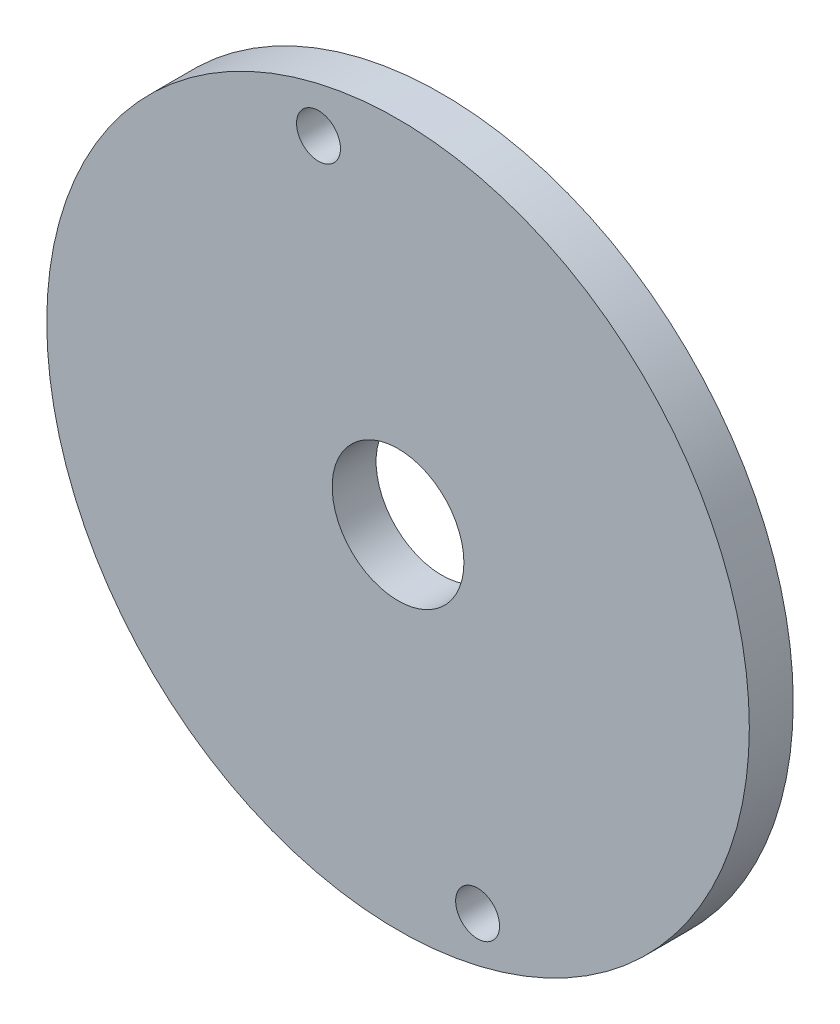
ISO-10303-21;
HEADER;
FILE_DESCRIPTION(('STEP AP214'),'2;1');
FILE_NAME('part.step','',(''),(''),'','','');
FILE_SCHEMA(('AUTOMOTIVE_DESIGN { 1 0 10303 214 1 1 1 1 }'));
ENDSEC;
DATA;
#1=APPLICATION_CONTEXT('core data for automotive mechanical design processes');
#2=APPLICATION_PROTOCOL_DEFINITION('international standard','automotive_design',2000,#1);
#3=PRODUCT_CONTEXT('',#1,'mechanical');
#4=PRODUCT('Part','Part','',(#3));
#5=PRODUCT_RELATED_PRODUCT_CATEGORY('part','',(#4));
#6=PRODUCT_DEFINITION_FORMATION('','',#4);
#7=PRODUCT_DEFINITION_CONTEXT('part definition',#1,'design');
#8=PRODUCT_DEFINITION('design','',#6,#7);
#9=PRODUCT_DEFINITION_SHAPE('','',#8);
#10=(LENGTH_UNIT() NAMED_UNIT(*) SI_UNIT(.MILLI.,.METRE.));
#11=(NAMED_UNIT(*) PLANE_ANGLE_UNIT() SI_UNIT($,.RADIAN.));
#12=(NAMED_UNIT(*) SI_UNIT($,.STERADIAN.) SOLID_ANGLE_UNIT());
#13=UNCERTAINTY_MEASURE_WITH_UNIT(LENGTH_MEASURE(1.E-05),#10,'distance_accuracy_value','');
#14=(GEOMETRIC_REPRESENTATION_CONTEXT(3) GLOBAL_UNCERTAINTY_ASSIGNED_CONTEXT((#13)) GLOBAL_UNIT_ASSIGNED_CONTEXT((#10,
#11,#12)) REPRESENTATION_CONTEXT('',''));
#15=CARTESIAN_POINT('',(0.,0.,0.));
#16=DIRECTION('',(0.,0.,1.));
#17=DIRECTION('',(1.,0.,0.));
#18=AXIS2_PLACEMENT_3D('',#15,#16,#17);
#19=CARTESIAN_POINT('',(0.,0.,110.));
#20=DIRECTION('',(0.,0.,1.));
#21=DIRECTION('',(1.,0.,0.));
#22=AXIS2_PLACEMENT_3D('',#19,#20,#21);
#23=PLANE('',#22);
#24=CARTESIAN_POINT('',(-18.1173331571765,67.6148078402348,110.));
#25=DIRECTION('',(0.,0.,1.));
#26=DIRECTION('',(1.,0.,0.));
#27=AXIS2_PLACEMENT_3D('',#24,#25,#26);
#28=CIRCLE('',#27,5.00000000000001);
#29=CARTESIAN_POINT('',(-13.1173331571765,67.6148078402348,110.));
#30=VERTEX_POINT('',#29);
#31=EDGE_CURVE('E58',#30,#30,#28,.T.);
#32=ORIENTED_EDGE('',*,*,#31,.F.);
#33=EDGE_LOOP('',(#32));
#34=FACE_BOUND('',#33,.T.);
#35=CARTESIAN_POINT('',(0.,0.,110.));
#36=DIRECTION('',(0.,0.,1.));
#37=DIRECTION('',(1.,0.,0.));
#38=AXIS2_PLACEMENT_3D('',#35,#36,#37);
#39=CIRCLE('',#38,80.);
#40=CARTESIAN_POINT('',(80.,0.,110.));
#41=VERTEX_POINT('',#40);
#42=EDGE_CURVE('E10',#41,#41,#39,.T.);
#43=ORIENTED_EDGE('',*,*,#42,.T.);
#44=EDGE_LOOP('',(#43));
#45=FACE_BOUND('',#44,.T.);
#46=CARTESIAN_POINT('',(0.,0.,110.));
#47=DIRECTION('',(0.,0.,1.));
#48=DIRECTION('',(1.,0.,0.));
#49=AXIS2_PLACEMENT_3D('',#46,#47,#48);
#50=CIRCLE('',#49,15.);
#51=CARTESIAN_POINT('',(15.,0.,110.));
#52=VERTEX_POINT('',#51);
#53=EDGE_CURVE('E52',#52,#52,#50,.T.);
#54=ORIENTED_EDGE('',*,*,#53,.F.);
#55=EDGE_LOOP('',(#54));
#56=FACE_BOUND('',#55,.T.);
#57=CARTESIAN_POINT('',(18.1173331571765,-67.6148078402348,110.));
#58=DIRECTION('',(0.,0.,1.));
#59=DIRECTION('',(1.,0.,0.));
#60=AXIS2_PLACEMENT_3D('',#57,#58,#59);
#61=CIRCLE('',#60,5.00000000000001);
#62=CARTESIAN_POINT('',(23.1173331571765,-67.6148078402348,110.));
#63=VERTEX_POINT('',#62);
#64=EDGE_CURVE('E65',#63,#63,#61,.T.);
#65=ORIENTED_EDGE('',*,*,#64,.F.);
#66=EDGE_LOOP('',(#65));
#67=FACE_BOUND('',#66,.T.);
#68=ADVANCED_FACE('F36',(#34,#45,#56,#67),#23,.T.);
#69=CARTESIAN_POINT('',(0.,0.,100.));
#70=DIRECTION('',(0.,0.,1.));
#71=DIRECTION('',(1.,0.,0.));
#72=AXIS2_PLACEMENT_3D('',#69,#70,#71);
#73=PLANE('',#72);
#74=CARTESIAN_POINT('',(0.,0.,100.));
#75=DIRECTION('',(0.,0.,1.));
#76=DIRECTION('',(1.,0.,0.));
#77=AXIS2_PLACEMENT_3D('',#74,#75,#76);
#78=CIRCLE('',#77,80.);
#79=CARTESIAN_POINT('',(80.,0.,100.));
#80=VERTEX_POINT('',#79);
#81=EDGE_CURVE('E40',#80,#80,#78,.T.);
#82=ORIENTED_EDGE('',*,*,#81,.F.);
#83=EDGE_LOOP('',(#82));
#84=FACE_BOUND('',#83,.T.);
#85=CARTESIAN_POINT('',(0.,0.,100.));
#86=DIRECTION('',(0.,0.,1.));
#87=DIRECTION('',(1.,0.,0.));
#88=AXIS2_PLACEMENT_3D('',#85,#86,#87);
#89=CIRCLE('',#88,15.);
#90=CARTESIAN_POINT('',(15.,0.,100.));
#91=VERTEX_POINT('',#90);
#92=EDGE_CURVE('E54',#91,#91,#89,.T.);
#93=ORIENTED_EDGE('',*,*,#92,.T.);
#94=EDGE_LOOP('',(#93));
#95=FACE_BOUND('',#94,.T.);
#96=CARTESIAN_POINT('',(-18.1173331571765,67.6148078402348,100.));
#97=DIRECTION('',(0.,0.,1.));
#98=DIRECTION('',(1.,0.,0.));
#99=AXIS2_PLACEMENT_3D('',#96,#97,#98);
#100=CIRCLE('',#99,5.00000000000001);
#101=CARTESIAN_POINT('',(-13.1173331571765,67.6148078402348,100.));
#102=VERTEX_POINT('',#101);
#103=EDGE_CURVE('E61',#102,#102,#100,.T.);
#104=ORIENTED_EDGE('',*,*,#103,.T.);
#105=EDGE_LOOP('',(#104));
#106=FACE_BOUND('',#105,.T.);
#107=CARTESIAN_POINT('',(18.1173331571765,-67.6148078402348,100.));
#108=DIRECTION('',(0.,0.,1.));
#109=DIRECTION('',(1.,0.,0.));
#110=AXIS2_PLACEMENT_3D('',#107,#108,#109);
#111=CIRCLE('',#110,5.00000000000001);
#112=CARTESIAN_POINT('',(23.1173331571765,-67.6148078402348,100.));
#113=VERTEX_POINT('',#112);
#114=EDGE_CURVE('E68',#113,#113,#111,.T.);
#115=ORIENTED_EDGE('',*,*,#114,.T.);
#116=EDGE_LOOP('',(#115));
#117=FACE_BOUND('',#116,.T.);
#118=ADVANCED_FACE('F81',(#84,#95,#106,#117),#73,.F.);
#119=CARTESIAN_POINT('',(0.,0.,110.));
#120=DIRECTION('',(0.,0.,-1.));
#121=DIRECTION('',(-1.,0.,0.));
#122=AXIS2_PLACEMENT_3D('',#119,#120,#121);
#123=CYLINDRICAL_SURFACE('',#122,80.);
#124=ORIENTED_EDGE('',*,*,#42,.F.);
#125=EDGE_LOOP('',(#124));
#126=FACE_BOUND('',#125,.T.);
#127=ORIENTED_EDGE('',*,*,#81,.T.);
#128=EDGE_LOOP('',(#127));
#129=FACE_BOUND('',#128,.T.);
#130=ADVANCED_FACE('F38',(#126,#129),#123,.T.);
#131=CARTESIAN_POINT('',(0.,0.,110.));
#132=DIRECTION('',(0.,0.,-1.));
#133=DIRECTION('',(-1.,0.,0.));
#134=AXIS2_PLACEMENT_3D('',#131,#132,#133);
#135=CYLINDRICAL_SURFACE('',#134,15.);
#136=ORIENTED_EDGE('',*,*,#53,.T.);
#137=EDGE_LOOP('',(#136));
#138=FACE_BOUND('',#137,.T.);
#139=ORIENTED_EDGE('',*,*,#92,.F.);
#140=EDGE_LOOP('',(#139));
#141=FACE_BOUND('',#140,.T.);
#142=ADVANCED_FACE('F90',(#138,#141),#135,.F.);
#143=CARTESIAN_POINT('',(-18.1173331571765,67.6148078402348,110.));
#144=DIRECTION('',(0.,0.,-1.));
#145=DIRECTION('',(-1.,0.,0.));
#146=AXIS2_PLACEMENT_3D('',#143,#144,#145);
#147=CYLINDRICAL_SURFACE('',#146,5.00000000000001);
#148=ORIENTED_EDGE('',*,*,#31,.T.);
#149=EDGE_LOOP('',(#148));
#150=FACE_BOUND('',#149,.T.);
#151=ORIENTED_EDGE('',*,*,#103,.F.);
#152=EDGE_LOOP('',(#151));
#153=FACE_BOUND('',#152,.T.);
#154=ADVANCED_FACE('F93',(#150,#153),#147,.F.);
#155=CARTESIAN_POINT('',(18.1173331571765,-67.6148078402348,110.));
#156=DIRECTION('',(0.,0.,-1.));
#157=DIRECTION('',(-1.,0.,0.));
#158=AXIS2_PLACEMENT_3D('',#155,#156,#157);
#159=CYLINDRICAL_SURFACE('',#158,5.00000000000001);
#160=ORIENTED_EDGE('',*,*,#64,.T.);
#161=EDGE_LOOP('',(#160));
#162=FACE_BOUND('',#161,.T.);
#163=ORIENTED_EDGE('',*,*,#114,.F.);
#164=EDGE_LOOP('',(#163));
#165=FACE_BOUND('',#164,.T.);
#166=ADVANCED_FACE('F77',(#162,#165),#159,.F.);
#167=CLOSED_SHELL('',(#68,#118,#130,#142,#154,#166));
#168=MANIFOLD_SOLID_BREP('B2',#167);
#169=ADVANCED_BREP_SHAPE_REPRESENTATION('',(#18,#168),#14);
#170=SHAPE_DEFINITION_REPRESENTATION(#9,#169);
ENDSEC;
END-ISO-10303-21;
